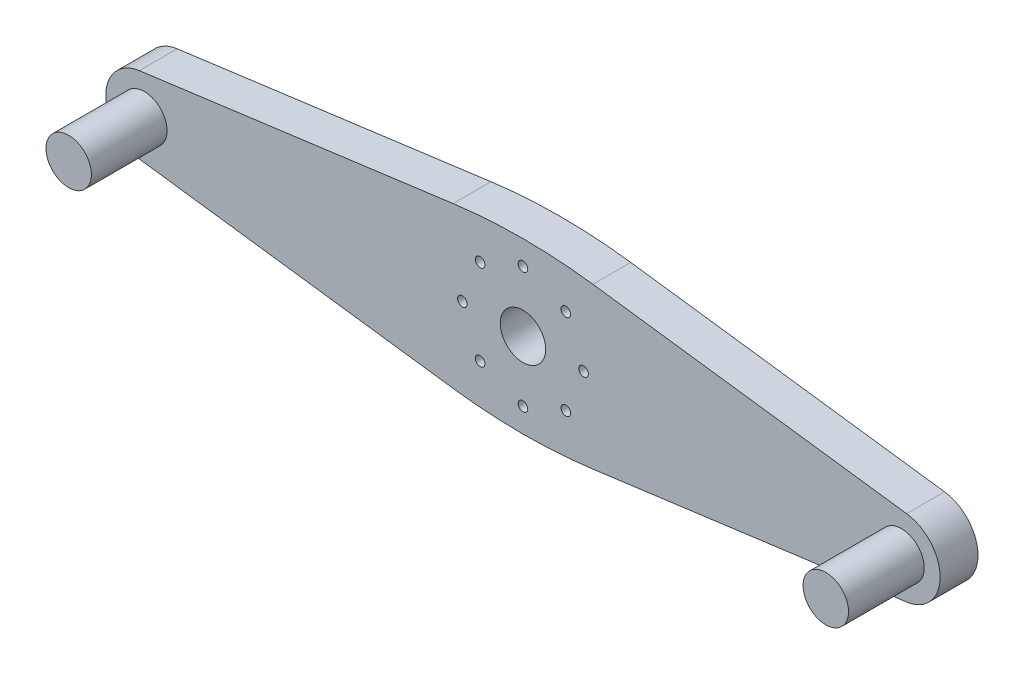
ISO-10303-21;
HEADER;
FILE_DESCRIPTION(('STEP AP214'),'2;1');
FILE_NAME('part.step','',(''),(''),'','','');
FILE_SCHEMA(('AUTOMOTIVE_DESIGN { 1 0 10303 214 1 1 1 1 }'));
ENDSEC;
DATA;
#1=APPLICATION_CONTEXT('core data for automotive mechanical design processes');
#2=APPLICATION_PROTOCOL_DEFINITION('international standard','automotive_design',2000,#1);
#3=PRODUCT_CONTEXT('',#1,'mechanical');
#4=PRODUCT('Part','Part','',(#3));
#5=PRODUCT_RELATED_PRODUCT_CATEGORY('part','',(#4));
#6=PRODUCT_DEFINITION_FORMATION('','',#4);
#7=PRODUCT_DEFINITION_CONTEXT('part definition',#1,'design');
#8=PRODUCT_DEFINITION('design','',#6,#7);
#9=PRODUCT_DEFINITION_SHAPE('','',#8);
#10=(LENGTH_UNIT() NAMED_UNIT(*) SI_UNIT(.MILLI.,.METRE.));
#11=(NAMED_UNIT(*) PLANE_ANGLE_UNIT() SI_UNIT($,.RADIAN.));
#12=(NAMED_UNIT(*) SI_UNIT($,.STERADIAN.) SOLID_ANGLE_UNIT());
#13=UNCERTAINTY_MEASURE_WITH_UNIT(LENGTH_MEASURE(1.E-05),#10,'distance_accuracy_value','');
#14=(GEOMETRIC_REPRESENTATION_CONTEXT(3) GLOBAL_UNCERTAINTY_ASSIGNED_CONTEXT((#13)) GLOBAL_UNIT_ASSIGNED_CONTEXT((#10,
#11,#12)) REPRESENTATION_CONTEXT('',''));
#15=CARTESIAN_POINT('',(0.,0.,0.));
#16=DIRECTION('',(0.,0.,1.));
#17=DIRECTION('',(1.,0.,0.));
#18=AXIS2_PLACEMENT_3D('',#15,#16,#17);
#19=CARTESIAN_POINT('',(50.,0.,5.));
#20=DIRECTION('',(0.,0.,-1.));
#21=DIRECTION('',(-1.,0.,0.));
#22=AXIS2_PLACEMENT_3D('',#19,#20,#21);
#23=PLANE('',#22);
#24=CARTESIAN_POINT('',(50.,0.,5.));
#25=DIRECTION('',(0.,0.,1.));
#26=DIRECTION('',(-1.,0.,0.));
#27=AXIS2_PLACEMENT_3D('',#24,#25,#26);
#28=CIRCLE('',#27,5.10024633771241);
#29=CARTESIAN_POINT('',(50.6728763500851,-5.05566515137672,5.));
#30=VERTEX_POINT('',#29);
#31=CARTESIAN_POINT('',(50.6728763500851,5.05566515137672,5.));
#32=VERTEX_POINT('',#31);
#33=EDGE_CURVE('E148',#30,#32,#28,.T.);
#34=ORIENTED_EDGE('',*,*,#33,.T.);
#35=DIRECTION('',(-0.991259013117456,0.131930166805804,0.));
#36=VECTOR('',#35,1.);
#37=CARTESIAN_POINT('',(50.6728763500851,5.05566515137672,5.));
#38=LINE('',#37,#36);
#39=CARTESIAN_POINT('',(9.2351116764065,10.5707637614413,5.));
#40=VERTEX_POINT('',#39);
#41=EDGE_CURVE('E96',#32,#40,#38,.T.);
#42=ORIENTED_EDGE('',*,*,#41,.T.);
#43=CARTESIAN_POINT('',(0.,-58.8173671567806,5.));
#44=DIRECTION('',(0.,0.,1.));
#45=DIRECTION('',(-1.,0.,0.));
#46=AXIS2_PLACEMENT_3D('',#43,#44,#45);
#47=CIRCLE('',#46,70.);
#48=CARTESIAN_POINT('',(-9.23511167640649,10.5707637614413,5.));
#49=VERTEX_POINT('',#48);
#50=EDGE_CURVE('E163',#40,#49,#47,.T.);
#51=ORIENTED_EDGE('',*,*,#50,.T.);
#52=DIRECTION('',(-0.991259013117456,-0.131930166805804,0.));
#53=VECTOR('',#52,1.);
#54=CARTESIAN_POINT('',(-50.6728763500851,5.05566515137672,5.));
#55=LINE('',#54,#53);
#56=CARTESIAN_POINT('',(-50.6728763500851,5.05566515137672,5.));
#57=VERTEX_POINT('',#56);
#58=EDGE_CURVE('E176',#49,#57,#55,.T.);
#59=ORIENTED_EDGE('',*,*,#58,.T.);
#60=CARTESIAN_POINT('',(-50.,0.,5.));
#61=DIRECTION('',(0.,0.,1.));
#62=DIRECTION('',(1.,0.,0.));
#63=AXIS2_PLACEMENT_3D('',#60,#61,#62);
#64=CIRCLE('',#63,5.10024633771241);
#65=CARTESIAN_POINT('',(-50.6728763500851,-5.05566515137672,5.));
#66=VERTEX_POINT('',#65);
#67=EDGE_CURVE('E115',#57,#66,#64,.T.);
#68=ORIENTED_EDGE('',*,*,#67,.T.);
#69=DIRECTION('',(0.991259013117456,-0.131930166805804,0.));
#70=VECTOR('',#69,1.);
#71=CARTESIAN_POINT('',(-50.6728763500851,-5.05566515137672,5.));
#72=LINE('',#71,#70);
#73=CARTESIAN_POINT('',(-9.23511167640653,-10.5707637614413,5.));
#74=VERTEX_POINT('',#73);
#75=EDGE_CURVE('E109',#66,#74,#72,.T.);
#76=ORIENTED_EDGE('',*,*,#75,.T.);
#77=CARTESIAN_POINT('',(0.,58.8173671567806,5.));
#78=DIRECTION('',(0.,0.,1.));
#79=DIRECTION('',(1.,0.,0.));
#80=AXIS2_PLACEMENT_3D('',#77,#78,#79);
#81=CIRCLE('',#80,70.);
#82=CARTESIAN_POINT('',(9.23511167640649,-10.5707637614413,5.));
#83=VERTEX_POINT('',#82);
#84=EDGE_CURVE('E113',#74,#83,#81,.T.);
#85=ORIENTED_EDGE('',*,*,#84,.T.);
#86=DIRECTION('',(0.991259013117456,0.131930166805804,0.));
#87=VECTOR('',#86,1.);
#88=CARTESIAN_POINT('',(50.6728763500851,-5.05566515137672,5.));
#89=LINE('',#88,#87);
#90=EDGE_CURVE('E53',#83,#30,#89,.T.);
#91=ORIENTED_EDGE('',*,*,#90,.T.);
#92=EDGE_LOOP('',(#34,#42,#51,#59,#68,#76,#85,#91));
#93=FACE_BOUND('',#92,.T.);
#94=CARTESIAN_POINT('',(0.,0.,5.));
#95=DIRECTION('',(0.,0.,1.));
#96=DIRECTION('',(1.,0.,0.));
#97=AXIS2_PLACEMENT_3D('',#94,#95,#96);
#98=CIRCLE('',#97,3.);
#99=CARTESIAN_POINT('',(3.,0.,5.));
#100=VERTEX_POINT('',#99);
#101=EDGE_CURVE('E137',#100,#100,#98,.T.);
#102=ORIENTED_EDGE('',*,*,#101,.F.);
#103=EDGE_LOOP('',(#102));
#104=FACE_BOUND('',#103,.T.);
#105=CARTESIAN_POINT('',(-8.,0.,5.));
#106=DIRECTION('',(0.,0.,1.));
#107=DIRECTION('',(1.,0.,0.));
#108=AXIS2_PLACEMENT_3D('',#105,#106,#107);
#109=CIRCLE('',#108,0.635000000000001);
#110=CARTESIAN_POINT('',(-7.365,0.,5.));
#111=VERTEX_POINT('',#110);
#112=EDGE_CURVE('E185',#111,#111,#109,.T.);
#113=ORIENTED_EDGE('',*,*,#112,.F.);
#114=EDGE_LOOP('',(#113));
#115=FACE_BOUND('',#114,.T.);
#116=CARTESIAN_POINT('',(-50.,0.,5.));
#117=DIRECTION('',(0.,0.,1.));
#118=DIRECTION('',(1.,0.,0.));
#119=AXIS2_PLACEMENT_3D('',#116,#117,#118);
#120=CIRCLE('',#119,3.);
#121=CARTESIAN_POINT('',(-47.,0.,5.));
#122=VERTEX_POINT('',#121);
#123=EDGE_CURVE('E191',#122,#122,#120,.T.);
#124=ORIENTED_EDGE('',*,*,#123,.F.);
#125=EDGE_LOOP('',(#124));
#126=FACE_BOUND('',#125,.T.);
#127=CARTESIAN_POINT('',(-5.65685424949237,5.65685424949239,5.));
#128=DIRECTION('',(0.,0.,1.));
#129=DIRECTION('',(1.,0.,0.));
#130=AXIS2_PLACEMENT_3D('',#127,#128,#129);
#131=CIRCLE('',#130,0.635000000000001);
#132=CARTESIAN_POINT('',(-5.02185424949237,5.65685424949239,5.));
#133=VERTEX_POINT('',#132);
#134=EDGE_CURVE('E196',#133,#133,#131,.T.);
#135=ORIENTED_EDGE('',*,*,#134,.F.);
#136=EDGE_LOOP('',(#135));
#137=FACE_BOUND('',#136,.T.);
#138=CARTESIAN_POINT('',(0.,8.,5.));
#139=DIRECTION('',(0.,0.,1.));
#140=DIRECTION('',(1.,0.,0.));
#141=AXIS2_PLACEMENT_3D('',#138,#139,#140);
#142=CIRCLE('',#141,0.635000000000001);
#143=CARTESIAN_POINT('',(0.63500000000003,8.,5.));
#144=VERTEX_POINT('',#143);
#145=EDGE_CURVE('E200',#144,#144,#142,.T.);
#146=ORIENTED_EDGE('',*,*,#145,.F.);
#147=EDGE_LOOP('',(#146));
#148=FACE_BOUND('',#147,.T.);
#149=CARTESIAN_POINT('',(50.,0.,5.));
#150=DIRECTION('',(0.,0.,1.));
#151=DIRECTION('',(-1.,0.,0.));
#152=AXIS2_PLACEMENT_3D('',#149,#150,#151);
#153=CIRCLE('',#152,3.);
#154=CARTESIAN_POINT('',(47.,0.,5.));
#155=VERTEX_POINT('',#154);
#156=EDGE_CURVE('E206',#155,#155,#153,.T.);
#157=ORIENTED_EDGE('',*,*,#156,.F.);
#158=EDGE_LOOP('',(#157));
#159=FACE_BOUND('',#158,.T.);
#160=CARTESIAN_POINT('',(5.65685424949241,5.65685424949235,5.));
#161=DIRECTION('',(0.,0.,1.));
#162=DIRECTION('',(1.,0.,0.));
#163=AXIS2_PLACEMENT_3D('',#160,#161,#162);
#164=CIRCLE('',#163,0.635);
#165=CARTESIAN_POINT('',(6.29185424949241,5.65685424949235,5.));
#166=VERTEX_POINT('',#165);
#167=EDGE_CURVE('E211',#166,#166,#164,.T.);
#168=ORIENTED_EDGE('',*,*,#167,.F.);
#169=EDGE_LOOP('',(#168));
#170=FACE_BOUND('',#169,.T.);
#171=CARTESIAN_POINT('',(8.,0.,5.));
#172=DIRECTION('',(0.,0.,1.));
#173=DIRECTION('',(1.,0.,0.));
#174=AXIS2_PLACEMENT_3D('',#171,#172,#173);
#175=CIRCLE('',#174,0.635);
#176=CARTESIAN_POINT('',(8.635,0.,5.));
#177=VERTEX_POINT('',#176);
#178=EDGE_CURVE('E215',#177,#177,#175,.T.);
#179=ORIENTED_EDGE('',*,*,#178,.F.);
#180=EDGE_LOOP('',(#179));
#181=FACE_BOUND('',#180,.T.);
#182=CARTESIAN_POINT('',(5.65685424949233,-5.65685424949243,5.));
#183=DIRECTION('',(0.,0.,1.));
#184=DIRECTION('',(1.,0.,0.));
#185=AXIS2_PLACEMENT_3D('',#182,#183,#184);
#186=CIRCLE('',#185,0.635000000000001);
#187=CARTESIAN_POINT('',(6.29185424949233,-5.65685424949243,5.));
#188=VERTEX_POINT('',#187);
#189=EDGE_CURVE('E221',#188,#188,#186,.T.);
#190=ORIENTED_EDGE('',*,*,#189,.F.);
#191=EDGE_LOOP('',(#190));
#192=FACE_BOUND('',#191,.T.);
#193=CARTESIAN_POINT('',(0.,-8.,5.));
#194=DIRECTION('',(0.,0.,1.));
#195=DIRECTION('',(1.,0.,0.));
#196=AXIS2_PLACEMENT_3D('',#193,#194,#195);
#197=CIRCLE('',#196,0.635);
#198=CARTESIAN_POINT('',(0.634999999999915,-8.,5.));
#199=VERTEX_POINT('',#198);
#200=EDGE_CURVE('E227',#199,#199,#197,.T.);
#201=ORIENTED_EDGE('',*,*,#200,.F.);
#202=EDGE_LOOP('',(#201));
#203=FACE_BOUND('',#202,.T.);
#204=CARTESIAN_POINT('',(-5.65685424949245,-5.65685424949231,5.));
#205=DIRECTION('',(0.,0.,1.));
#206=DIRECTION('',(1.,0.,0.));
#207=AXIS2_PLACEMENT_3D('',#204,#205,#206);
#208=CIRCLE('',#207,0.635);
#209=CARTESIAN_POINT('',(-5.02185424949245,-5.65685424949231,5.));
#210=VERTEX_POINT('',#209);
#211=EDGE_CURVE('E233',#210,#210,#208,.T.);
#212=ORIENTED_EDGE('',*,*,#211,.F.);
#213=EDGE_LOOP('',(#212));
#214=FACE_BOUND('',#213,.T.);
#215=ADVANCED_FACE('F36',(#93,#104,#115,#126,#137,#148,#159,#170,#181,#192,#203,#214),#23,.F.);
#216=CARTESIAN_POINT('',(50.,0.,0.));
#217=DIRECTION('',(0.,0.,-1.));
#218=DIRECTION('',(-1.,0.,0.));
#219=AXIS2_PLACEMENT_3D('',#216,#217,#218);
#220=PLANE('',#219);
#221=CARTESIAN_POINT('',(0.,-8.,0.));
#222=DIRECTION('',(0.,0.,1.));
#223=DIRECTION('',(1.,0.,0.));
#224=AXIS2_PLACEMENT_3D('',#221,#222,#223);
#225=CIRCLE('',#224,0.635);
#226=CARTESIAN_POINT('',(0.634999999999915,-8.,0.));
#227=VERTEX_POINT('',#226);
#228=EDGE_CURVE('E230',#227,#227,#225,.T.);
#229=ORIENTED_EDGE('',*,*,#228,.T.);
#230=EDGE_LOOP('',(#229));
#231=FACE_BOUND('',#230,.T.);
#232=CARTESIAN_POINT('',(8.,0.,0.));
#233=DIRECTION('',(0.,0.,1.));
#234=DIRECTION('',(1.,0.,0.));
#235=AXIS2_PLACEMENT_3D('',#232,#233,#234);
#236=CIRCLE('',#235,0.635);
#237=CARTESIAN_POINT('',(8.635,0.,0.));
#238=VERTEX_POINT('',#237);
#239=EDGE_CURVE('E218',#238,#238,#236,.T.);
#240=ORIENTED_EDGE('',*,*,#239,.T.);
#241=EDGE_LOOP('',(#240));
#242=FACE_BOUND('',#241,.T.);
#243=CARTESIAN_POINT('',(-5.65685424949237,5.65685424949239,0.));
#244=DIRECTION('',(0.,0.,1.));
#245=DIRECTION('',(1.,0.,0.));
#246=AXIS2_PLACEMENT_3D('',#243,#244,#245);
#247=CIRCLE('',#246,0.635000000000001);
#248=CARTESIAN_POINT('',(-5.02185424949237,5.65685424949239,0.));
#249=VERTEX_POINT('',#248);
#250=EDGE_CURVE('E197',#249,#249,#247,.T.);
#251=ORIENTED_EDGE('',*,*,#250,.T.);
#252=EDGE_LOOP('',(#251));
#253=FACE_BOUND('',#252,.T.);
#254=CARTESIAN_POINT('',(-8.,0.,0.));
#255=DIRECTION('',(0.,0.,1.));
#256=DIRECTION('',(1.,0.,0.));
#257=AXIS2_PLACEMENT_3D('',#254,#255,#256);
#258=CIRCLE('',#257,0.635000000000001);
#259=CARTESIAN_POINT('',(-7.365,0.,0.));
#260=VERTEX_POINT('',#259);
#261=EDGE_CURVE('E188',#260,#260,#258,.T.);
#262=ORIENTED_EDGE('',*,*,#261,.T.);
#263=EDGE_LOOP('',(#262));
#264=FACE_BOUND('',#263,.T.);
#265=CARTESIAN_POINT('',(50.,0.,0.));
#266=DIRECTION('',(0.,0.,1.));
#267=DIRECTION('',(-1.,0.,0.));
#268=AXIS2_PLACEMENT_3D('',#265,#266,#267);
#269=CIRCLE('',#268,5.10024633771241);
#270=CARTESIAN_POINT('',(50.6728763500851,-5.05566515137672,0.));
#271=VERTEX_POINT('',#270);
#272=CARTESIAN_POINT('',(50.6728763500851,5.05566515137672,0.));
#273=VERTEX_POINT('',#272);
#274=EDGE_CURVE('E133',#271,#273,#269,.T.);
#275=ORIENTED_EDGE('',*,*,#274,.F.);
#276=DIRECTION('',(0.991259013117456,0.131930166805804,0.));
#277=VECTOR('',#276,1.);
#278=CARTESIAN_POINT('',(50.6728763500851,-5.05566515137672,0.));
#279=LINE('',#278,#277);
#280=CARTESIAN_POINT('',(9.23511167640649,-10.5707637614413,0.));
#281=VERTEX_POINT('',#280);
#282=EDGE_CURVE('E88',#281,#271,#279,.T.);
#283=ORIENTED_EDGE('',*,*,#282,.F.);
#284=CARTESIAN_POINT('',(0.,58.8173671567806,0.));
#285=DIRECTION('',(0.,0.,1.));
#286=DIRECTION('',(1.,0.,0.));
#287=AXIS2_PLACEMENT_3D('',#284,#285,#286);
#288=CIRCLE('',#287,70.);
#289=CARTESIAN_POINT('',(-9.23511167640653,-10.5707637614413,0.));
#290=VERTEX_POINT('',#289);
#291=EDGE_CURVE('E82',#290,#281,#288,.T.);
#292=ORIENTED_EDGE('',*,*,#291,.F.);
#293=DIRECTION('',(0.991259013117456,-0.131930166805804,0.));
#294=VECTOR('',#293,1.);
#295=CARTESIAN_POINT('',(-50.6728763500851,-5.05566515137672,0.));
#296=LINE('',#295,#294);
#297=CARTESIAN_POINT('',(-50.6728763500851,-5.05566515137672,0.));
#298=VERTEX_POINT('',#297);
#299=EDGE_CURVE('E123',#298,#290,#296,.T.);
#300=ORIENTED_EDGE('',*,*,#299,.F.);
#301=CARTESIAN_POINT('',(-50.,0.,0.));
#302=DIRECTION('',(0.,0.,1.));
#303=DIRECTION('',(1.,0.,0.));
#304=AXIS2_PLACEMENT_3D('',#301,#302,#303);
#305=CIRCLE('',#304,5.10024633771241);
#306=CARTESIAN_POINT('',(-50.6728763500851,5.05566515137672,0.));
#307=VERTEX_POINT('',#306);
#308=EDGE_CURVE('E143',#307,#298,#305,.T.);
#309=ORIENTED_EDGE('',*,*,#308,.F.);
#310=DIRECTION('',(-0.991259013117456,-0.131930166805804,0.));
#311=VECTOR('',#310,1.);
#312=CARTESIAN_POINT('',(-50.6728763500851,5.05566515137672,0.));
#313=LINE('',#312,#311);
#314=CARTESIAN_POINT('',(-9.23511167640649,10.5707637614413,0.));
#315=VERTEX_POINT('',#314);
#316=EDGE_CURVE('E141',#315,#307,#313,.T.);
#317=ORIENTED_EDGE('',*,*,#316,.F.);
#318=CARTESIAN_POINT('',(0.,-58.8173671567806,0.));
#319=DIRECTION('',(0.,0.,1.));
#320=DIRECTION('',(-1.,0.,0.));
#321=AXIS2_PLACEMENT_3D('',#318,#319,#320);
#322=CIRCLE('',#321,70.);
#323=CARTESIAN_POINT('',(9.2351116764065,10.5707637614413,0.));
#324=VERTEX_POINT('',#323);
#325=EDGE_CURVE('E139',#324,#315,#322,.T.);
#326=ORIENTED_EDGE('',*,*,#325,.F.);
#327=DIRECTION('',(-0.991259013117456,0.131930166805804,0.));
#328=VECTOR('',#327,1.);
#329=CARTESIAN_POINT('',(50.6728763500851,5.05566515137672,0.));
#330=LINE('',#329,#328);
#331=EDGE_CURVE('E136',#273,#324,#330,.T.);
#332=ORIENTED_EDGE('',*,*,#331,.F.);
#333=EDGE_LOOP('',(#275,#283,#292,#300,#309,#317,#326,#332));
#334=FACE_BOUND('',#333,.T.);
#335=CARTESIAN_POINT('',(0.,0.,0.));
#336=DIRECTION('',(0.,0.,1.));
#337=DIRECTION('',(1.,0.,0.));
#338=AXIS2_PLACEMENT_3D('',#335,#336,#337);
#339=CIRCLE('',#338,3.);
#340=CARTESIAN_POINT('',(3.,0.,0.));
#341=VERTEX_POINT('',#340);
#342=EDGE_CURVE('E182',#341,#341,#339,.T.);
#343=ORIENTED_EDGE('',*,*,#342,.T.);
#344=EDGE_LOOP('',(#343));
#345=FACE_BOUND('',#344,.T.);
#346=CARTESIAN_POINT('',(0.,8.,0.));
#347=DIRECTION('',(0.,0.,1.));
#348=DIRECTION('',(1.,0.,0.));
#349=AXIS2_PLACEMENT_3D('',#346,#347,#348);
#350=CIRCLE('',#349,0.635000000000001);
#351=CARTESIAN_POINT('',(0.63500000000003,8.,0.));
#352=VERTEX_POINT('',#351);
#353=EDGE_CURVE('E203',#352,#352,#350,.T.);
#354=ORIENTED_EDGE('',*,*,#353,.T.);
#355=EDGE_LOOP('',(#354));
#356=FACE_BOUND('',#355,.T.);
#357=CARTESIAN_POINT('',(5.65685424949241,5.65685424949235,0.));
#358=DIRECTION('',(0.,0.,1.));
#359=DIRECTION('',(1.,0.,0.));
#360=AXIS2_PLACEMENT_3D('',#357,#358,#359);
#361=CIRCLE('',#360,0.635);
#362=CARTESIAN_POINT('',(6.29185424949241,5.65685424949235,0.));
#363=VERTEX_POINT('',#362);
#364=EDGE_CURVE('E212',#363,#363,#361,.T.);
#365=ORIENTED_EDGE('',*,*,#364,.T.);
#366=EDGE_LOOP('',(#365));
#367=FACE_BOUND('',#366,.T.);
#368=CARTESIAN_POINT('',(5.65685424949233,-5.65685424949243,0.));
#369=DIRECTION('',(0.,0.,1.));
#370=DIRECTION('',(1.,0.,0.));
#371=AXIS2_PLACEMENT_3D('',#368,#369,#370);
#372=CIRCLE('',#371,0.635000000000001);
#373=CARTESIAN_POINT('',(6.29185424949233,-5.65685424949243,0.));
#374=VERTEX_POINT('',#373);
#375=EDGE_CURVE('E224',#374,#374,#372,.T.);
#376=ORIENTED_EDGE('',*,*,#375,.T.);
#377=EDGE_LOOP('',(#376));
#378=FACE_BOUND('',#377,.T.);
#379=CARTESIAN_POINT('',(-5.65685424949245,-5.65685424949231,0.));
#380=DIRECTION('',(0.,0.,1.));
#381=DIRECTION('',(1.,0.,0.));
#382=AXIS2_PLACEMENT_3D('',#379,#380,#381);
#383=CIRCLE('',#382,0.635);
#384=CARTESIAN_POINT('',(-5.02185424949245,-5.65685424949231,0.));
#385=VERTEX_POINT('',#384);
#386=EDGE_CURVE('E236',#385,#385,#383,.T.);
#387=ORIENTED_EDGE('',*,*,#386,.T.);
#388=EDGE_LOOP('',(#387));
#389=FACE_BOUND('',#388,.T.);
#390=ADVANCED_FACE('F167',(#231,#242,#253,#264,#334,#345,#356,#367,#378,#389),#220,.T.);
#391=CARTESIAN_POINT('',(50.,0.,5.));
#392=DIRECTION('',(0.,0.,-1.));
#393=DIRECTION('',(-1.,0.,0.));
#394=AXIS2_PLACEMENT_3D('',#391,#392,#393);
#395=CYLINDRICAL_SURFACE('',#394,5.10024633771241);
#396=ORIENTED_EDGE('',*,*,#274,.T.);
#397=DIRECTION('',(0.,0.,-1.));
#398=VECTOR('',#397,1.);
#399=CARTESIAN_POINT('',(50.6728763500851,5.05566515137672,5.));
#400=LINE('',#399,#398);
#401=EDGE_CURVE('E11',#32,#273,#400,.T.);
#402=ORIENTED_EDGE('',*,*,#401,.F.);
#403=ORIENTED_EDGE('',*,*,#33,.F.);
#404=DIRECTION('',(0.,0.,-1.));
#405=VECTOR('',#404,1.);
#406=CARTESIAN_POINT('',(50.6728763500851,-5.05566515137672,5.));
#407=LINE('',#406,#405);
#408=EDGE_CURVE('E129',#30,#271,#407,.T.);
#409=ORIENTED_EDGE('',*,*,#408,.T.);
#410=EDGE_LOOP('',(#396,#402,#403,#409));
#411=FACE_BOUND('',#410,.T.);
#412=ADVANCED_FACE('F38',(#411),#395,.T.);
#413=CARTESIAN_POINT('',(50.6728763500851,5.05566515137672,5.));
#414=DIRECTION('',(-0.131930166805804,-0.991259013117456,0.));
#415=DIRECTION('',(0.991259013117456,-0.131930166805804,0.));
#416=AXIS2_PLACEMENT_3D('',#413,#414,#415);
#417=PLANE('',#416);
#418=ORIENTED_EDGE('',*,*,#331,.T.);
#419=DIRECTION('',(0.,0.,-1.));
#420=VECTOR('',#419,1.);
#421=CARTESIAN_POINT('',(9.2351116764065,10.5707637614413,5.));
#422=LINE('',#421,#420);
#423=EDGE_CURVE('E45',#40,#324,#422,.T.);
#424=ORIENTED_EDGE('',*,*,#423,.F.);
#425=ORIENTED_EDGE('',*,*,#41,.F.);
#426=ORIENTED_EDGE('',*,*,#401,.T.);
#427=EDGE_LOOP('',(#418,#424,#425,#426));
#428=FACE_BOUND('',#427,.T.);
#429=ADVANCED_FACE('F282',(#428),#417,.F.);
#430=CARTESIAN_POINT('',(0.,-58.8173671567806,5.));
#431=DIRECTION('',(0.,0.,-1.));
#432=DIRECTION('',(-1.,0.,0.));
#433=AXIS2_PLACEMENT_3D('',#430,#431,#432);
#434=CYLINDRICAL_SURFACE('',#433,70.);
#435=ORIENTED_EDGE('',*,*,#325,.T.);
#436=DIRECTION('',(0.,0.,-1.));
#437=VECTOR('',#436,1.);
#438=CARTESIAN_POINT('',(-9.23511167640649,10.5707637614413,5.));
#439=LINE('',#438,#437);
#440=EDGE_CURVE('E155',#49,#315,#439,.T.);
#441=ORIENTED_EDGE('',*,*,#440,.F.);
#442=ORIENTED_EDGE('',*,*,#50,.F.);
#443=ORIENTED_EDGE('',*,*,#423,.T.);
#444=EDGE_LOOP('',(#435,#441,#442,#443));
#445=FACE_BOUND('',#444,.T.);
#446=ADVANCED_FACE('F161',(#445),#434,.T.);
#447=CARTESIAN_POINT('',(-50.6728763500851,5.05566515137672,5.));
#448=DIRECTION('',(0.131930166805804,-0.991259013117456,0.));
#449=DIRECTION('',(0.991259013117456,0.131930166805804,0.));
#450=AXIS2_PLACEMENT_3D('',#447,#448,#449);
#451=PLANE('',#450);
#452=ORIENTED_EDGE('',*,*,#316,.T.);
#453=DIRECTION('',(0.,0.,-1.));
#454=VECTOR('',#453,1.);
#455=CARTESIAN_POINT('',(-50.6728763500851,5.05566515137672,5.));
#456=LINE('',#455,#454);
#457=EDGE_CURVE('E152',#57,#307,#456,.T.);
#458=ORIENTED_EDGE('',*,*,#457,.F.);
#459=ORIENTED_EDGE('',*,*,#58,.F.);
#460=ORIENTED_EDGE('',*,*,#440,.T.);
#461=EDGE_LOOP('',(#452,#458,#459,#460));
#462=FACE_BOUND('',#461,.T.);
#463=ADVANCED_FACE('F172',(#462),#451,.F.);
#464=CARTESIAN_POINT('',(-50.,0.,5.));
#465=DIRECTION('',(0.,0.,-1.));
#466=DIRECTION('',(-1.,0.,0.));
#467=AXIS2_PLACEMENT_3D('',#464,#465,#466);
#468=CYLINDRICAL_SURFACE('',#467,5.10024633771241);
#469=ORIENTED_EDGE('',*,*,#308,.T.);
#470=DIRECTION('',(0.,0.,-1.));
#471=VECTOR('',#470,1.);
#472=CARTESIAN_POINT('',(-50.6728763500851,-5.05566515137672,5.));
#473=LINE('',#472,#471);
#474=EDGE_CURVE('E124',#66,#298,#473,.T.);
#475=ORIENTED_EDGE('',*,*,#474,.F.);
#476=ORIENTED_EDGE('',*,*,#67,.F.);
#477=ORIENTED_EDGE('',*,*,#457,.T.);
#478=EDGE_LOOP('',(#469,#475,#476,#477));
#479=FACE_BOUND('',#478,.T.);
#480=ADVANCED_FACE('F175',(#479),#468,.T.);
#481=CARTESIAN_POINT('',(-50.6728763500851,-5.05566515137672,5.));
#482=DIRECTION('',(0.131930166805804,0.991259013117456,0.));
#483=DIRECTION('',(-0.991259013117456,0.131930166805804,0.));
#484=AXIS2_PLACEMENT_3D('',#481,#482,#483);
#485=PLANE('',#484);
#486=ORIENTED_EDGE('',*,*,#299,.T.);
#487=DIRECTION('',(0.,0.,-1.));
#488=VECTOR('',#487,1.);
#489=CARTESIAN_POINT('',(-9.23511167640653,-10.5707637614413,5.));
#490=LINE('',#489,#488);
#491=EDGE_CURVE('E120',#74,#290,#490,.T.);
#492=ORIENTED_EDGE('',*,*,#491,.F.);
#493=ORIENTED_EDGE('',*,*,#75,.F.);
#494=ORIENTED_EDGE('',*,*,#474,.T.);
#495=EDGE_LOOP('',(#486,#492,#493,#494));
#496=FACE_BOUND('',#495,.T.);
#497=ADVANCED_FACE('F121',(#496),#485,.F.);
#498=CARTESIAN_POINT('',(0.,58.8173671567806,5.));
#499=DIRECTION('',(0.,0.,-1.));
#500=DIRECTION('',(-1.,0.,0.));
#501=AXIS2_PLACEMENT_3D('',#498,#499,#500);
#502=CYLINDRICAL_SURFACE('',#501,70.);
#503=ORIENTED_EDGE('',*,*,#291,.T.);
#504=DIRECTION('',(0.,0.,-1.));
#505=VECTOR('',#504,1.);
#506=CARTESIAN_POINT('',(9.23511167640649,-10.5707637614413,5.));
#507=LINE('',#506,#505);
#508=EDGE_CURVE('E125',#83,#281,#507,.T.);
#509=ORIENTED_EDGE('',*,*,#508,.F.);
#510=ORIENTED_EDGE('',*,*,#84,.F.);
#511=ORIENTED_EDGE('',*,*,#491,.T.);
#512=EDGE_LOOP('',(#503,#509,#510,#511));
#513=FACE_BOUND('',#512,.T.);
#514=ADVANCED_FACE('F127',(#513),#502,.T.);
#515=CARTESIAN_POINT('',(50.6728763500851,-5.05566515137672,5.));
#516=DIRECTION('',(-0.131930166805804,0.991259013117456,0.));
#517=DIRECTION('',(-0.991259013117456,-0.131930166805804,0.));
#518=AXIS2_PLACEMENT_3D('',#515,#516,#517);
#519=PLANE('',#518);
#520=ORIENTED_EDGE('',*,*,#282,.T.);
#521=ORIENTED_EDGE('',*,*,#408,.F.);
#522=ORIENTED_EDGE('',*,*,#90,.F.);
#523=ORIENTED_EDGE('',*,*,#508,.T.);
#524=EDGE_LOOP('',(#520,#521,#522,#523));
#525=FACE_BOUND('',#524,.T.);
#526=ADVANCED_FACE('F270',(#525),#519,.F.);
#527=CARTESIAN_POINT('',(0.,0.,5.));
#528=DIRECTION('',(0.,0.,-1.));
#529=DIRECTION('',(-1.,0.,0.));
#530=AXIS2_PLACEMENT_3D('',#527,#528,#529);
#531=CYLINDRICAL_SURFACE('',#530,3.);
#532=ORIENTED_EDGE('',*,*,#101,.T.);
#533=EDGE_LOOP('',(#532));
#534=FACE_BOUND('',#533,.T.);
#535=ORIENTED_EDGE('',*,*,#342,.F.);
#536=EDGE_LOOP('',(#535));
#537=FACE_BOUND('',#536,.T.);
#538=ADVANCED_FACE('F267',(#534,#537),#531,.F.);
#539=CARTESIAN_POINT('',(-8.,0.,5.));
#540=DIRECTION('',(0.,0.,-1.));
#541=DIRECTION('',(-1.,0.,0.));
#542=AXIS2_PLACEMENT_3D('',#539,#540,#541);
#543=CYLINDRICAL_SURFACE('',#542,0.635000000000001);
#544=ORIENTED_EDGE('',*,*,#112,.T.);
#545=EDGE_LOOP('',(#544));
#546=FACE_BOUND('',#545,.T.);
#547=ORIENTED_EDGE('',*,*,#261,.F.);
#548=EDGE_LOOP('',(#547));
#549=FACE_BOUND('',#548,.T.);
#550=ADVANCED_FACE('F361',(#546,#549),#543,.F.);
#551=CARTESIAN_POINT('',(-5.65685424949237,5.65685424949239,5.));
#552=DIRECTION('',(0.,0.,-1.));
#553=DIRECTION('',(-1.,0.,0.));
#554=AXIS2_PLACEMENT_3D('',#551,#552,#553);
#555=CYLINDRICAL_SURFACE('',#554,0.635000000000001);
#556=ORIENTED_EDGE('',*,*,#134,.T.);
#557=EDGE_LOOP('',(#556));
#558=FACE_BOUND('',#557,.T.);
#559=ORIENTED_EDGE('',*,*,#250,.F.);
#560=EDGE_LOOP('',(#559));
#561=FACE_BOUND('',#560,.T.);
#562=ADVANCED_FACE('F358',(#558,#561),#555,.F.);
#563=CARTESIAN_POINT('',(0.,8.,5.));
#564=DIRECTION('',(0.,0.,-1.));
#565=DIRECTION('',(-1.,0.,0.));
#566=AXIS2_PLACEMENT_3D('',#563,#564,#565);
#567=CYLINDRICAL_SURFACE('',#566,0.635000000000001);
#568=ORIENTED_EDGE('',*,*,#145,.T.);
#569=EDGE_LOOP('',(#568));
#570=FACE_BOUND('',#569,.T.);
#571=ORIENTED_EDGE('',*,*,#353,.F.);
#572=EDGE_LOOP('',(#571));
#573=FACE_BOUND('',#572,.T.);
#574=ADVANCED_FACE('F354',(#570,#573),#567,.F.);
#575=CARTESIAN_POINT('',(5.65685424949241,5.65685424949235,5.));
#576=DIRECTION('',(0.,0.,-1.));
#577=DIRECTION('',(-1.,0.,0.));
#578=AXIS2_PLACEMENT_3D('',#575,#576,#577);
#579=CYLINDRICAL_SURFACE('',#578,0.635);
#580=ORIENTED_EDGE('',*,*,#167,.T.);
#581=EDGE_LOOP('',(#580));
#582=FACE_BOUND('',#581,.T.);
#583=ORIENTED_EDGE('',*,*,#364,.F.);
#584=EDGE_LOOP('',(#583));
#585=FACE_BOUND('',#584,.T.);
#586=ADVANCED_FACE('F350',(#582,#585),#579,.F.);
#587=CARTESIAN_POINT('',(8.,0.,5.));
#588=DIRECTION('',(0.,0.,-1.));
#589=DIRECTION('',(-1.,0.,0.));
#590=AXIS2_PLACEMENT_3D('',#587,#588,#589);
#591=CYLINDRICAL_SURFACE('',#590,0.635);
#592=ORIENTED_EDGE('',*,*,#178,.T.);
#593=EDGE_LOOP('',(#592));
#594=FACE_BOUND('',#593,.T.);
#595=ORIENTED_EDGE('',*,*,#239,.F.);
#596=EDGE_LOOP('',(#595));
#597=FACE_BOUND('',#596,.T.);
#598=ADVANCED_FACE('F346',(#594,#597),#591,.F.);
#599=CARTESIAN_POINT('',(5.65685424949233,-5.65685424949243,5.));
#600=DIRECTION('',(0.,0.,-1.));
#601=DIRECTION('',(-1.,0.,0.));
#602=AXIS2_PLACEMENT_3D('',#599,#600,#601);
#603=CYLINDRICAL_SURFACE('',#602,0.635000000000001);
#604=ORIENTED_EDGE('',*,*,#189,.T.);
#605=EDGE_LOOP('',(#604));
#606=FACE_BOUND('',#605,.T.);
#607=ORIENTED_EDGE('',*,*,#375,.F.);
#608=EDGE_LOOP('',(#607));
#609=FACE_BOUND('',#608,.T.);
#610=ADVANCED_FACE('F342',(#606,#609),#603,.F.);
#611=CARTESIAN_POINT('',(0.,-8.,5.));
#612=DIRECTION('',(0.,0.,-1.));
#613=DIRECTION('',(-1.,0.,0.));
#614=AXIS2_PLACEMENT_3D('',#611,#612,#613);
#615=CYLINDRICAL_SURFACE('',#614,0.635);
#616=ORIENTED_EDGE('',*,*,#200,.T.);
#617=EDGE_LOOP('',(#616));
#618=FACE_BOUND('',#617,.T.);
#619=ORIENTED_EDGE('',*,*,#228,.F.);
#620=EDGE_LOOP('',(#619));
#621=FACE_BOUND('',#620,.T.);
#622=ADVANCED_FACE('F338',(#618,#621),#615,.F.);
#623=CARTESIAN_POINT('',(-5.65685424949245,-5.65685424949231,5.));
#624=DIRECTION('',(0.,0.,-1.));
#625=DIRECTION('',(-1.,0.,0.));
#626=AXIS2_PLACEMENT_3D('',#623,#624,#625);
#627=CYLINDRICAL_SURFACE('',#626,0.635);
#628=ORIENTED_EDGE('',*,*,#211,.T.);
#629=EDGE_LOOP('',(#628));
#630=FACE_BOUND('',#629,.T.);
#631=ORIENTED_EDGE('',*,*,#386,.F.);
#632=EDGE_LOOP('',(#631));
#633=FACE_BOUND('',#632,.T.);
#634=ADVANCED_FACE('F304',(#630,#633),#627,.F.);
#635=CARTESIAN_POINT('',(-50.,0.,15.));
#636=DIRECTION('',(0.,0.,-1.));
#637=DIRECTION('',(-1.,0.,0.));
#638=AXIS2_PLACEMENT_3D('',#635,#636,#637);
#639=CYLINDRICAL_SURFACE('',#638,3.);
#640=CARTESIAN_POINT('',(-50.,0.,15.));
#641=DIRECTION('',(0.,0.,1.));
#642=DIRECTION('',(1.,0.,0.));
#643=AXIS2_PLACEMENT_3D('',#640,#641,#642);
#644=CIRCLE('',#643,3.);
#645=CARTESIAN_POINT('',(-47.,0.,15.));
#646=VERTEX_POINT('',#645);
#647=EDGE_CURVE('E239',#646,#646,#644,.T.);
#648=ORIENTED_EDGE('',*,*,#647,.F.);
#649=EDGE_LOOP('',(#648));
#650=FACE_BOUND('',#649,.T.);
#651=ORIENTED_EDGE('',*,*,#123,.T.);
#652=EDGE_LOOP('',(#651));
#653=FACE_BOUND('',#652,.T.);
#654=ADVANCED_FACE('F309',(#650,#653),#639,.T.);
#655=CARTESIAN_POINT('',(0.,0.,15.));
#656=DIRECTION('',(0.,0.,1.));
#657=DIRECTION('',(1.,0.,0.));
#658=AXIS2_PLACEMENT_3D('',#655,#656,#657);
#659=PLANE('',#658);
#660=ORIENTED_EDGE('',*,*,#647,.T.);
#661=EDGE_LOOP('',(#660));
#662=FACE_BOUND('',#661,.T.);
#663=ADVANCED_FACE('F257',(#662),#659,.T.);
#664=CARTESIAN_POINT('',(50.,0.,15.));
#665=DIRECTION('',(0.,0.,-1.));
#666=DIRECTION('',(-1.,0.,0.));
#667=AXIS2_PLACEMENT_3D('',#664,#665,#666);
#668=CYLINDRICAL_SURFACE('',#667,3.);
#669=CARTESIAN_POINT('',(50.,0.,15.));
#670=DIRECTION('',(0.,0.,1.));
#671=DIRECTION('',(1.,0.,0.));
#672=AXIS2_PLACEMENT_3D('',#669,#670,#671);
#673=CIRCLE('',#672,3.);
#674=CARTESIAN_POINT('',(53.,0.,15.));
#675=VERTEX_POINT('',#674);
#676=EDGE_CURVE('E244',#675,#675,#673,.F.);
#677=ORIENTED_EDGE('',*,*,#676,.T.);
#678=EDGE_LOOP('',(#677));
#679=FACE_BOUND('',#678,.T.);
#680=ORIENTED_EDGE('',*,*,#156,.T.);
#681=EDGE_LOOP('',(#680));
#682=FACE_BOUND('',#681,.T.);
#683=ADVANCED_FACE('F248',(#679,#682),#668,.T.);
#684=CARTESIAN_POINT('',(0.,0.,15.));
#685=DIRECTION('',(0.,0.,1.));
#686=DIRECTION('',(1.,0.,0.));
#687=AXIS2_PLACEMENT_3D('',#684,#685,#686);
#688=PLANE('',#687);
#689=ORIENTED_EDGE('',*,*,#676,.F.);
#690=EDGE_LOOP('',(#689));
#691=FACE_BOUND('',#690,.T.);
#692=ADVANCED_FACE('F251',(#691),#688,.T.);
#693=CLOSED_SHELL('',(#215,#390,#412,#429,#446,#463,#480,#497,#514,#526,#538,#550,#562,#574,
#586,#598,#610,#622,#634,#654,#663,#683,#692));
#694=MANIFOLD_SOLID_BREP('B2',#693);
#695=ADVANCED_BREP_SHAPE_REPRESENTATION('',(#18,#694),#14);
#696=SHAPE_DEFINITION_REPRESENTATION(#9,#695);
ENDSEC;
END-ISO-10303-21;
